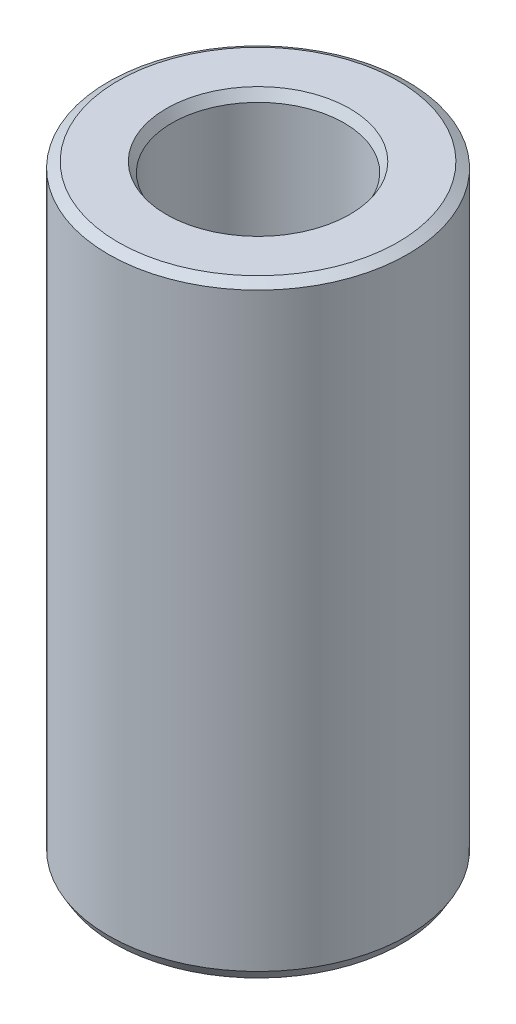
ISO-10303-21;
HEADER;
FILE_DESCRIPTION(('STEP AP214'),'2;1');
FILE_NAME('part.step','',(''),(''),'','','');
FILE_SCHEMA(('AUTOMOTIVE_DESIGN { 1 0 10303 214 1 1 1 1 }'));
ENDSEC;
DATA;
#1=APPLICATION_CONTEXT('core data for automotive mechanical design processes');
#2=APPLICATION_PROTOCOL_DEFINITION('international standard','automotive_design',2000,#1);
#3=PRODUCT_CONTEXT('',#1,'mechanical');
#4=PRODUCT('Part','Part','',(#3));
#5=PRODUCT_RELATED_PRODUCT_CATEGORY('part','',(#4));
#6=PRODUCT_DEFINITION_FORMATION('','',#4);
#7=PRODUCT_DEFINITION_CONTEXT('part definition',#1,'design');
#8=PRODUCT_DEFINITION('design','',#6,#7);
#9=PRODUCT_DEFINITION_SHAPE('','',#8);
#10=(LENGTH_UNIT() NAMED_UNIT(*) SI_UNIT(.MILLI.,.METRE.));
#11=(NAMED_UNIT(*) PLANE_ANGLE_UNIT() SI_UNIT($,.RADIAN.));
#12=(NAMED_UNIT(*) SI_UNIT($,.STERADIAN.) SOLID_ANGLE_UNIT());
#13=UNCERTAINTY_MEASURE_WITH_UNIT(LENGTH_MEASURE(1.E-05),#10,'distance_accuracy_value','');
#14=(GEOMETRIC_REPRESENTATION_CONTEXT(3) GLOBAL_UNCERTAINTY_ASSIGNED_CONTEXT((#13)) GLOBAL_UNIT_ASSIGNED_CONTEXT((#10,
#11,#12)) REPRESENTATION_CONTEXT('',''));
#15=CARTESIAN_POINT('',(0.,0.,0.));
#16=DIRECTION('',(0.,0.,1.));
#17=DIRECTION('',(1.,0.,0.));
#18=AXIS2_PLACEMENT_3D('',#15,#16,#17);
#19=CARTESIAN_POINT('',(0.,80.9529969471509,0.));
#20=DIRECTION('',(0.,-1.,0.));
#21=DIRECTION('',(0.,0.,-1.));
#22=AXIS2_PLACEMENT_3D('',#19,#20,#21);
#23=CYLINDRICAL_SURFACE('',#22,20.);
#24=CARTESIAN_POINT('',(0.,1.29029463063056,0.));
#25=DIRECTION('',(0.,1.,0.));
#26=DIRECTION('',(0.,0.,1.));
#27=AXIS2_PLACEMENT_3D('',#24,#25,#26);
#28=CIRCLE('',#27,20.);
#29=CARTESIAN_POINT('',(0.,1.29029463063056,20.));
#30=VERTEX_POINT('',#29);
#31=EDGE_CURVE('E10',#30,#30,#28,.T.);
#32=ORIENTED_EDGE('',*,*,#31,.T.);
#33=EDGE_LOOP('',(#32));
#34=FACE_BOUND('',#33,.T.);
#35=CARTESIAN_POINT('',(0.,80.1937503123861,0.));
#36=DIRECTION('',(0.,1.,0.));
#37=DIRECTION('',(0.,0.,1.));
#38=AXIS2_PLACEMENT_3D('',#35,#36,#37);
#39=CIRCLE('',#38,20.);
#40=CARTESIAN_POINT('',(0.,80.1937503123861,20.));
#41=VERTEX_POINT('',#40);
#42=EDGE_CURVE('E50',#41,#41,#39,.F.);
#43=ORIENTED_EDGE('',*,*,#42,.T.);
#44=EDGE_LOOP('',(#43));
#45=FACE_BOUND('',#44,.T.);
#46=ADVANCED_FACE('F39',(#34,#45),#23,.T.);
#47=CARTESIAN_POINT('',(0.,80.9529969471509,0.));
#48=DIRECTION('',(0.,1.,0.));
#49=DIRECTION('',(0.,0.,1.));
#50=AXIS2_PLACEMENT_3D('',#47,#48,#49);
#51=PLANE('',#50);
#52=CARTESIAN_POINT('',(0.,80.9529969471509,0.));
#53=DIRECTION('',(0.,1.,0.));
#54=DIRECTION('',(0.,0.,1.));
#55=AXIS2_PLACEMENT_3D('',#52,#53,#54);
#56=CIRCLE('',#55,12.2710682584568);
#57=CARTESIAN_POINT('',(0.,80.9529969471509,12.2710682584568));
#58=VERTEX_POINT('',#57);
#59=EDGE_CURVE('E58',#58,#58,#56,.F.);
#60=ORIENTED_EDGE('',*,*,#59,.T.);
#61=EDGE_LOOP('',(#60));
#62=FACE_BOUND('',#61,.T.);
#63=CARTESIAN_POINT('',(0.,80.9529969471509,0.));
#64=DIRECTION('',(0.,1.,0.));
#65=DIRECTION('',(0.,0.,1.));
#66=AXIS2_PLACEMENT_3D('',#63,#64,#65);
#67=CIRCLE('',#66,18.7097053693694);
#68=CARTESIAN_POINT('',(0.,80.9529969471509,18.7097053693694));
#69=VERTEX_POINT('',#68);
#70=EDGE_CURVE('E61',#69,#69,#67,.T.);
#71=ORIENTED_EDGE('',*,*,#70,.T.);
#72=EDGE_LOOP('',(#71));
#73=FACE_BOUND('',#72,.T.);
#74=ADVANCED_FACE('F88',(#62,#73),#51,.T.);
#75=CARTESIAN_POINT('',(0.,0.,0.));
#76=DIRECTION('',(0.,1.,0.));
#77=DIRECTION('',(0.,0.,1.));
#78=AXIS2_PLACEMENT_3D('',#75,#76,#77);
#79=PLANE('',#78);
#80=CARTESIAN_POINT('',(0.,0.,0.));
#81=DIRECTION('',(0.,1.,0.));
#82=DIRECTION('',(0.,0.,1.));
#83=AXIS2_PLACEMENT_3D('',#80,#81,#82);
#84=CIRCLE('',#83,12.8021162543226);
#85=CARTESIAN_POINT('',(0.,0.,-12.8021162543226));
#86=VERTEX_POINT('',#85);
#87=EDGE_CURVE('E51',#86,#86,#84,.T.);
#88=ORIENTED_EDGE('',*,*,#87,.T.);
#89=EDGE_LOOP('',(#88));
#90=FACE_BOUND('',#89,.T.);
#91=CARTESIAN_POINT('',(0.,0.,0.));
#92=DIRECTION('',(0.,1.,0.));
#93=DIRECTION('',(0.,0.,1.));
#94=AXIS2_PLACEMENT_3D('',#91,#92,#93);
#95=CIRCLE('',#94,19.2407533652352);
#96=CARTESIAN_POINT('',(0.,0.,19.2407533652352));
#97=VERTEX_POINT('',#96);
#98=EDGE_CURVE('E54',#97,#97,#95,.F.);
#99=ORIENTED_EDGE('',*,*,#98,.T.);
#100=EDGE_LOOP('',(#99));
#101=FACE_BOUND('',#100,.T.);
#102=ADVANCED_FACE('F83',(#90,#101),#79,.F.);
#103=CARTESIAN_POINT('',(0.,80.9529969471509,0.));
#104=DIRECTION('',(0.,-1.,0.));
#105=DIRECTION('',(0.,0.,-1.));
#106=AXIS2_PLACEMENT_3D('',#103,#104,#105);
#107=CYLINDRICAL_SURFACE('',#106,11.511821623692);
#108=CARTESIAN_POINT('',(0.,79.6627023165203,0.));
#109=DIRECTION('',(0.,1.,0.));
#110=DIRECTION('',(0.,0.,1.));
#111=AXIS2_PLACEMENT_3D('',#108,#109,#110);
#112=CIRCLE('',#111,11.511821623692);
#113=CARTESIAN_POINT('',(0.,79.6627023165203,11.511821623692));
#114=VERTEX_POINT('',#113);
#115=EDGE_CURVE('E67',#114,#114,#112,.T.);
#116=ORIENTED_EDGE('',*,*,#115,.T.);
#117=EDGE_LOOP('',(#116));
#118=FACE_BOUND('',#117,.T.);
#119=CARTESIAN_POINT('',(0.,0.759246634764787,0.));
#120=DIRECTION('',(0.,1.,0.));
#121=DIRECTION('',(0.,0.,1.));
#122=AXIS2_PLACEMENT_3D('',#119,#120,#121);
#123=CIRCLE('',#122,11.511821623692);
#124=CARTESIAN_POINT('',(0.,0.759246634764787,-11.511821623692));
#125=VERTEX_POINT('',#124);
#126=EDGE_CURVE('E69',#125,#125,#123,.F.);
#127=ORIENTED_EDGE('',*,*,#126,.T.);
#128=EDGE_LOOP('',(#127));
#129=FACE_BOUND('',#128,.T.);
#130=ADVANCED_FACE('F71',(#118,#129),#107,.F.);
#131=CARTESIAN_POINT('',(0.,79.6627023165203,0.));
#132=DIRECTION('',(0.,1.,0.));
#133=DIRECTION('',(0.,0.,1.));
#134=AXIS2_PLACEMENT_3D('',#131,#132,#133);
#135=CONICAL_SURFACE('',#134,11.511821623692,0.531867881948553);
#136=ORIENTED_EDGE('',*,*,#59,.F.);
#137=EDGE_LOOP('',(#136));
#138=FACE_BOUND('',#137,.T.);
#139=ORIENTED_EDGE('',*,*,#115,.F.);
#140=EDGE_LOOP('',(#139));
#141=FACE_BOUND('',#140,.T.);
#142=ADVANCED_FACE('F77',(#138,#141),#135,.F.);
#143=CARTESIAN_POINT('',(0.,0.,0.));
#144=DIRECTION('',(0.,-1.,0.));
#145=DIRECTION('',(0.,0.,-1.));
#146=AXIS2_PLACEMENT_3D('',#143,#144,#145);
#147=CONICAL_SURFACE('',#146,12.8021162543226,1.03892844484634);
#148=CARTESIAN_POINT('',(0.,0.759246634764787,-11.511821623692));
#149=CARTESIAN_POINT('',(0.,0.751337815652654,-11.5252621927611));
#150=CARTESIAN_POINT('',(0.,0.743428996540521,-11.5387027618302));
#151=CARTESIAN_POINT('',(0.,0.727611358316255,-11.5655838999683));
#152=CARTESIAN_POINT('',(0.,0.719702539204121,-11.5790244690374));
#153=CARTESIAN_POINT('',(0.,0.703884900979855,-11.6059056071755));
#154=CARTESIAN_POINT('',(0.,0.695976081867722,-11.6193461762446));
#155=CARTESIAN_POINT('',(0.,0.680158443643455,-11.6462273143827));
#156=CARTESIAN_POINT('',(0.,0.672249624531322,-11.6596678834518));
#157=CARTESIAN_POINT('',(0.,0.656431986307056,-11.6865490215899));
#158=CARTESIAN_POINT('',(0.,0.648523167194923,-11.699989590659));
#159=CARTESIAN_POINT('',(0.,0.632705528970656,-11.7268707287971));
#160=CARTESIAN_POINT('',(0.,0.624796709858523,-11.7403112978662));
#161=CARTESIAN_POINT('',(0.,0.608979071634256,-11.7671924360043));
#162=CARTESIAN_POINT('',(0.,0.601070252522123,-11.7806330050734));
#163=CARTESIAN_POINT('',(0.,0.585252614297857,-11.8075141432115));
#164=CARTESIAN_POINT('',(0.,0.577343795185724,-11.8209547122806));
#165=CARTESIAN_POINT('',(0.,0.561526156961457,-11.8478358504187));
#166=CARTESIAN_POINT('',(0.,0.553617337849324,-11.8612764194878));
#167=CARTESIAN_POINT('',(0.,0.537799699625058,-11.8881575576259));
#168=CARTESIAN_POINT('',(0.,0.529890880512924,-11.901598126695));
#169=CARTESIAN_POINT('',(0.,0.514073242288658,-11.9284792648331));
#170=CARTESIAN_POINT('',(0.,0.506164423176525,-11.9419198339022));
#171=CARTESIAN_POINT('',(0.,0.490346784952259,-11.9688009720403));
#172=CARTESIAN_POINT('',(0.,0.482437965840125,-11.9822415411094));
#173=CARTESIAN_POINT('',(0.,0.466620327615859,-12.0091226792476));
#174=CARTESIAN_POINT('',(0.,0.458711508503726,-12.0225632483166));
#175=CARTESIAN_POINT('',(0.,0.442893870279459,-12.0494443864548));
#176=CARTESIAN_POINT('',(0.,0.434985051167326,-12.0628849555238));
#177=CARTESIAN_POINT('',(0.,0.41916741294306,-12.089766093662));
#178=CARTESIAN_POINT('',(0.,0.411258593830927,-12.103206662731));
#179=CARTESIAN_POINT('',(0.,0.39544095560666,-12.1300878008692));
#180=CARTESIAN_POINT('',(0.,0.387532136494527,-12.1435283699382));
#181=CARTESIAN_POINT('',(0.,0.37171449827026,-12.1704095080764));
#182=CARTESIAN_POINT('',(0.,0.363805679158127,-12.1838500771454));
#183=CARTESIAN_POINT('',(0.,0.347988040933861,-12.2107312152836));
#184=CARTESIAN_POINT('',(0.,0.340079221821728,-12.2241717843527));
#185=CARTESIAN_POINT('',(0.,0.324261583597461,-12.2510529224908));
#186=CARTESIAN_POINT('',(0.,0.316352764485328,-12.2644934915599));
#187=CARTESIAN_POINT('',(0.,0.300535126261062,-12.291374629698));
#188=CARTESIAN_POINT('',(0.,0.292626307148929,-12.3048151987671));
#189=CARTESIAN_POINT('',(0.,0.276808668924662,-12.3316963369052));
#190=CARTESIAN_POINT('',(0.,0.268899849812529,-12.3451369059743));
#191=CARTESIAN_POINT('',(0.,0.253082211588262,-12.3720180441124));
#192=CARTESIAN_POINT('',(0.,0.245173392476129,-12.3854586131815));
#193=CARTESIAN_POINT('',(0.,0.229355754251863,-12.4123397513196));
#194=CARTESIAN_POINT('',(0.,0.22144693513973,-12.4257803203887));
#195=CARTESIAN_POINT('',(0.,0.205629296915463,-12.4526614585268));
#196=CARTESIAN_POINT('',(0.,0.19772047780333,-12.4661020275959));
#197=CARTESIAN_POINT('',(0.,0.181902839579064,-12.492983165734));
#198=CARTESIAN_POINT('',(0.,0.173994020466931,-12.5064237348031));
#199=CARTESIAN_POINT('',(0.,0.158176382242664,-12.5333048729412));
#200=CARTESIAN_POINT('',(0.,0.150267563130531,-12.5467454420103));
#201=CARTESIAN_POINT('',(0.,0.134449924906264,-12.5736265801484));
#202=CARTESIAN_POINT('',(0.,0.126541105794131,-12.5870671492175));
#203=CARTESIAN_POINT('',(0.,0.110723467569865,-12.6139482873556));
#204=CARTESIAN_POINT('',(0.,0.102814648457732,-12.6273888564247));
#205=CARTESIAN_POINT('',(0.,0.0869970102334654,-12.6542699945629));
#206=CARTESIAN_POINT('',(0.,0.0790881911213321,-12.6677105636319));
#207=CARTESIAN_POINT('',(0.,0.0632705528970655,-12.6945917017701));
#208=CARTESIAN_POINT('',(0.,0.0553617337849323,-12.7080322708391));
#209=CARTESIAN_POINT('',(0.,0.0395440955606659,-12.7349134089773));
#210=CARTESIAN_POINT('',(0.,0.0316352764485328,-12.7483539780463));
#211=CARTESIAN_POINT('',(0.,0.0158176382242666,-12.7752351161845));
#212=CARTESIAN_POINT('',(0.,0.00790881911213356,-12.7886756852535));
#213=CARTESIAN_POINT('',(0.,0.,-12.8021162543226));
#214=B_SPLINE_CURVE_WITH_KNOTS('',3,(#148,#149,#150,#151,#152,#153,#154,#155,#156,#157,#158,
#159,#160,#161,#162,#163,#164,#165,#166,#167,#168,#169,#170,#171,#172,#173,#174,#175,#176,#177,
#178,#179,#180,#181,#182,#183,#184,#185,#186,#187,#188,#189,#190,#191,#192,#193,#194,#195,#196,
#197,#198,#199,#200,#201,#202,#203,#204,#205,#206,#207,#208,#209,#210,#211,#212,#213),
.UNSPECIFIED.,.F.,.F.,(4,2,2,2,2,2,2,2,2,2,2,2,2,2,2,2,2,2,2,2,2,2,2,2,2,2,2,2,2,2,2,2,4),(0.,
0.0467844509408798,0.0935689018817611,0.140353352822641,0.187137803763521,0.233922254704402,
0.280706705645282,0.327491156586162,0.374275607527043,0.421060058467923,0.467844509408803,
0.514628960349684,0.561413411290564,0.608197862231445,0.654982313172325,0.701766764113205,
0.748551215054085,0.795335665994966,0.842120116935846,0.888904567876727,0.935689018817607,
0.982473469758487,1.02925792069937,1.07604237164025,1.12282682258113,1.16961127352201,
1.21639572446289,1.26318017540377,1.30996462634465,1.35674907728553,1.40353352822641,
1.45031797916729,1.49710243010817),.UNSPECIFIED.);
#215=EDGE_CURVE('BSEAM73',#125,#86,#214,.T.);
#216=ORIENTED_EDGE('',*,*,#126,.F.);
#217=ORIENTED_EDGE('',*,*,#87,.F.);
#218=ORIENTED_EDGE('',*,*,#215,.T.);
#219=ORIENTED_EDGE('',*,*,#215,.F.);
#220=EDGE_LOOP('',(#216,#218,#217,#219));
#221=FACE_BOUND('',#220,.T.);
#222=ADVANCED_FACE('F73',(#221),#147,.F.);
#223=CARTESIAN_POINT('',(0.,1.29029463063056,0.));
#224=DIRECTION('',(0.,1.,0.));
#225=DIRECTION('',(0.,0.,1.));
#226=AXIS2_PLACEMENT_3D('',#223,#224,#225);
#227=CONICAL_SURFACE('',#226,20.,0.531867881948557);
#228=ORIENTED_EDGE('',*,*,#98,.F.);
#229=EDGE_LOOP('',(#228));
#230=FACE_BOUND('',#229,.T.);
#231=ORIENTED_EDGE('',*,*,#31,.F.);
#232=EDGE_LOOP('',(#231));
#233=FACE_BOUND('',#232,.T.);
#234=ADVANCED_FACE('F76',(#230,#233),#227,.T.);
#235=CARTESIAN_POINT('',(0.,80.9529969471509,0.));
#236=DIRECTION('',(0.,-1.,0.));
#237=DIRECTION('',(0.,0.,-1.));
#238=AXIS2_PLACEMENT_3D('',#235,#236,#237);
#239=CONICAL_SURFACE('',#238,18.7097053693694,1.03892844484634);
#240=ORIENTED_EDGE('',*,*,#42,.F.);
#241=EDGE_LOOP('',(#240));
#242=FACE_BOUND('',#241,.T.);
#243=ORIENTED_EDGE('',*,*,#70,.F.);
#244=EDGE_LOOP('',(#243));
#245=FACE_BOUND('',#244,.T.);
#246=ADVANCED_FACE('F45',(#242,#245),#239,.T.);
#247=CLOSED_SHELL('',(#46,#74,#102,#130,#142,#222,#234,#246));
#248=MANIFOLD_SOLID_BREP('B2',#247);
#249=ADVANCED_BREP_SHAPE_REPRESENTATION('',(#18,#248),#14);
#250=SHAPE_DEFINITION_REPRESENTATION(#9,#249);
ENDSEC;
END-ISO-10303-21;
